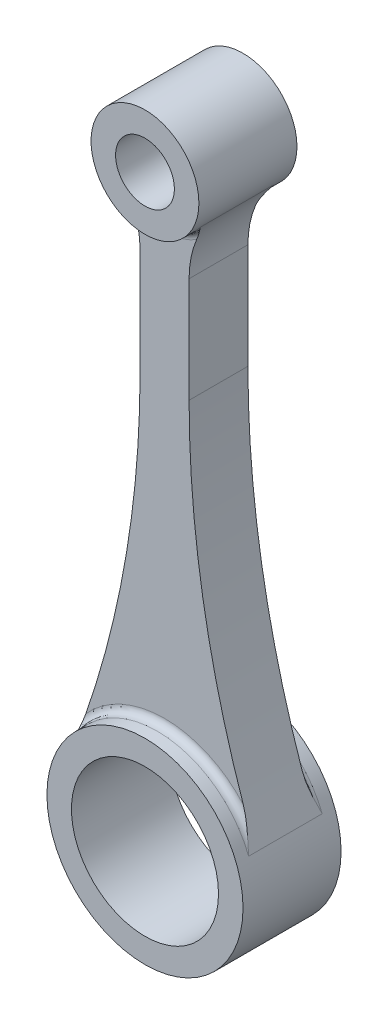
ISO-10303-21;
HEADER;
FILE_DESCRIPTION(('STEP AP214'),'2;1');
FILE_NAME('part.step','',(''),(''),'','','');
FILE_SCHEMA(('AUTOMOTIVE_DESIGN { 1 0 10303 214 1 1 1 1 }'));
ENDSEC;
DATA;
#1=APPLICATION_CONTEXT('core data for automotive mechanical design processes');
#2=APPLICATION_PROTOCOL_DEFINITION('international standard','automotive_design',2000,#1);
#3=PRODUCT_CONTEXT('',#1,'mechanical');
#4=PRODUCT('Part','Part','',(#3));
#5=PRODUCT_RELATED_PRODUCT_CATEGORY('part','',(#4));
#6=PRODUCT_DEFINITION_FORMATION('','',#4);
#7=PRODUCT_DEFINITION_CONTEXT('part definition',#1,'design');
#8=PRODUCT_DEFINITION('design','',#6,#7);
#9=PRODUCT_DEFINITION_SHAPE('','',#8);
#10=(LENGTH_UNIT() NAMED_UNIT(*) SI_UNIT(.MILLI.,.METRE.));
#11=(NAMED_UNIT(*) PLANE_ANGLE_UNIT() SI_UNIT($,.RADIAN.));
#12=(NAMED_UNIT(*) SI_UNIT($,.STERADIAN.) SOLID_ANGLE_UNIT());
#13=UNCERTAINTY_MEASURE_WITH_UNIT(LENGTH_MEASURE(1.E-05),#10,'distance_accuracy_value','');
#14=(GEOMETRIC_REPRESENTATION_CONTEXT(3) GLOBAL_UNCERTAINTY_ASSIGNED_CONTEXT((#13)) GLOBAL_UNIT_ASSIGNED_CONTEXT((#10,
#11,#12)) REPRESENTATION_CONTEXT('',''));
#15=CARTESIAN_POINT('',(0.,0.,0.));
#16=DIRECTION('',(0.,0.,1.));
#17=DIRECTION('',(1.,0.,0.));
#18=AXIS2_PLACEMENT_3D('',#15,#16,#17);
#19=CARTESIAN_POINT('',(0.,0.,10.));
#20=DIRECTION('',(0.,0.,-1.));
#21=DIRECTION('',(-1.,0.,0.));
#22=AXIS2_PLACEMENT_3D('',#19,#20,#21);
#23=CYLINDRICAL_SURFACE('',#22,20.);
#24=CARTESIAN_POINT('',(0.,0.,-10.));
#25=DIRECTION('',(0.,0.,1.));
#26=DIRECTION('',(1.,0.,0.));
#27=AXIS2_PLACEMENT_3D('',#24,#25,#26);
#28=CIRCLE('',#27,20.);
#29=CARTESIAN_POINT('',(20.,0.,-10.));
#30=VERTEX_POINT('',#29);
#31=EDGE_CURVE('E199',#30,#30,#28,.T.);
#32=ORIENTED_EDGE('',*,*,#31,.T.);
#33=EDGE_LOOP('',(#32));
#34=FACE_BOUND('',#33,.T.);
#35=CARTESIAN_POINT('',(0.,0.,10.));
#36=DIRECTION('',(0.,0.,1.));
#37=DIRECTION('',(1.,0.,0.));
#38=AXIS2_PLACEMENT_3D('',#35,#36,#37);
#39=CIRCLE('',#38,20.);
#40=CARTESIAN_POINT('',(20.,0.,10.));
#41=VERTEX_POINT('',#40);
#42=EDGE_CURVE('E203',#41,#41,#39,.T.);
#43=ORIENTED_EDGE('',*,*,#42,.F.);
#44=EDGE_LOOP('',(#43));
#45=FACE_BOUND('',#44,.T.);
#46=CARTESIAN_POINT('',(0.,0.,-7.5));
#47=DIRECTION('',(0.,0.,-1.));
#48=DIRECTION('',(-1.,0.,0.));
#49=AXIS2_PLACEMENT_3D('',#46,#47,#48);
#50=CIRCLE('',#49,20.);
#51=CARTESIAN_POINT('',(-18.6481142651053,7.22826634509108,-7.5));
#52=VERTEX_POINT('',#51);
#53=CARTESIAN_POINT('',(18.6481142651053,7.22826634509112,-7.5));
#54=VERTEX_POINT('',#53);
#55=EDGE_CURVE('E214',#52,#54,#50,.T.);
#56=ORIENTED_EDGE('',*,*,#55,.T.);
#57=DIRECTION('',(0.,0.,-1.));
#58=VECTOR('',#57,1.);
#59=CARTESIAN_POINT('',(18.6481142651053,7.22826634509114,6.));
#60=LINE('',#59,#58);
#61=CARTESIAN_POINT('',(18.6481142651053,7.22826634509112,7.5));
#62=VERTEX_POINT('',#61);
#63=EDGE_CURVE('E190',#62,#54,#60,.T.);
#64=ORIENTED_EDGE('',*,*,#63,.F.);
#65=CARTESIAN_POINT('',(0.,0.,7.5));
#66=DIRECTION('',(0.,0.,-1.));
#67=DIRECTION('',(-1.,0.,0.));
#68=AXIS2_PLACEMENT_3D('',#65,#66,#67);
#69=CIRCLE('',#68,20.);
#70=CARTESIAN_POINT('',(-18.6481142651053,7.22826634509108,7.5));
#71=VERTEX_POINT('',#70);
#72=EDGE_CURVE('E207',#62,#71,#69,.F.);
#73=ORIENTED_EDGE('',*,*,#72,.T.);
#74=DIRECTION('',(0.,0.,-1.));
#75=VECTOR('',#74,1.);
#76=CARTESIAN_POINT('',(-18.6481142651053,7.22826634509108,6.));
#77=LINE('',#76,#75);
#78=EDGE_CURVE('E158',#71,#52,#77,.T.);
#79=ORIENTED_EDGE('',*,*,#78,.T.);
#80=EDGE_LOOP('',(#56,#64,#73,#79));
#81=FACE_BOUND('',#80,.T.);
#82=ADVANCED_FACE('F44',(#34,#45,#81),#23,.T.);
#83=CARTESIAN_POINT('',(0.,0.,10.));
#84=DIRECTION('',(0.,0.,1.));
#85=DIRECTION('',(1.,0.,0.));
#86=AXIS2_PLACEMENT_3D('',#83,#84,#85);
#87=PLANE('',#86);
#88=ORIENTED_EDGE('',*,*,#42,.T.);
#89=EDGE_LOOP('',(#88));
#90=FACE_BOUND('',#89,.T.);
#91=CARTESIAN_POINT('',(0.,0.,10.));
#92=DIRECTION('',(0.,0.,1.));
#93=DIRECTION('',(1.,0.,0.));
#94=AXIS2_PLACEMENT_3D('',#91,#92,#93);
#95=CIRCLE('',#94,15.);
#96=CARTESIAN_POINT('',(15.,0.,10.));
#97=VERTEX_POINT('',#96);
#98=EDGE_CURVE('E195',#97,#97,#95,.T.);
#99=ORIENTED_EDGE('',*,*,#98,.F.);
#100=EDGE_LOOP('',(#99));
#101=FACE_BOUND('',#100,.T.);
#102=ADVANCED_FACE('F374',(#90,#101),#87,.T.);
#103=CARTESIAN_POINT('',(0.,0.,-10.));
#104=DIRECTION('',(0.,0.,1.));
#105=DIRECTION('',(1.,0.,0.));
#106=AXIS2_PLACEMENT_3D('',#103,#104,#105);
#107=PLANE('',#106);
#108=ORIENTED_EDGE('',*,*,#31,.F.);
#109=EDGE_LOOP('',(#108));
#110=FACE_BOUND('',#109,.T.);
#111=CARTESIAN_POINT('',(0.,0.,-10.));
#112=DIRECTION('',(0.,0.,1.));
#113=DIRECTION('',(1.,0.,0.));
#114=AXIS2_PLACEMENT_3D('',#111,#112,#113);
#115=CIRCLE('',#114,15.);
#116=CARTESIAN_POINT('',(15.,0.,-10.));
#117=VERTEX_POINT('',#116);
#118=EDGE_CURVE('E157',#117,#117,#115,.T.);
#119=ORIENTED_EDGE('',*,*,#118,.T.);
#120=EDGE_LOOP('',(#119));
#121=FACE_BOUND('',#120,.T.);
#122=ADVANCED_FACE('F379',(#110,#121),#107,.F.);
#123=CARTESIAN_POINT('',(0.,0.,10.));
#124=DIRECTION('',(0.,0.,-1.));
#125=DIRECTION('',(-1.,0.,0.));
#126=AXIS2_PLACEMENT_3D('',#123,#124,#125);
#127=CYLINDRICAL_SURFACE('',#126,15.);
#128=ORIENTED_EDGE('',*,*,#98,.T.);
#129=EDGE_LOOP('',(#128));
#130=FACE_BOUND('',#129,.T.);
#131=ORIENTED_EDGE('',*,*,#118,.F.);
#132=EDGE_LOOP('',(#131));
#133=FACE_BOUND('',#132,.T.);
#134=ADVANCED_FACE('F385',(#130,#133),#127,.F.);
#135=CARTESIAN_POINT('',(-5.,80.2020410288673,6.));
#136=DIRECTION('',(1.,0.,0.));
#137=DIRECTION('',(0.,1.,0.));
#138=AXIS2_PLACEMENT_3D('',#135,#136,#137);
#139=PLANE('',#138);
#140=DIRECTION('',(0.,-1.,0.));
#141=VECTOR('',#140,1.);
#142=CARTESIAN_POINT('',(-5.,80.2020410288673,6.));
#143=LINE('',#142,#141);
#144=CARTESIAN_POINT('',(-5.,101.669697220177,6.));
#145=VERTEX_POINT('',#144);
#146=CARTESIAN_POINT('',(-5.,80.2020410288673,6.));
#147=VERTEX_POINT('',#146);
#148=EDGE_CURVE('E134',#145,#147,#143,.T.);
#149=ORIENTED_EDGE('',*,*,#148,.F.);
#150=DIRECTION('',(0.,0.,1.));
#151=VECTOR('',#150,1.);
#152=CARTESIAN_POINT('',(-5.,101.669697220177,-7.5));
#153=LINE('',#152,#151);
#154=CARTESIAN_POINT('',(-5.,101.669697220177,-6.));
#155=VERTEX_POINT('',#154);
#156=EDGE_CURVE('E323',#145,#155,#153,.F.);
#157=ORIENTED_EDGE('',*,*,#156,.T.);
#158=DIRECTION('',(0.,-1.,0.));
#159=VECTOR('',#158,1.);
#160=CARTESIAN_POINT('',(-5.,80.2020410288673,-6.));
#161=LINE('',#160,#159);
#162=CARTESIAN_POINT('',(-5.,80.2020410288673,-6.));
#163=VERTEX_POINT('',#162);
#164=EDGE_CURVE('E152',#155,#163,#161,.T.);
#165=ORIENTED_EDGE('',*,*,#164,.T.);
#166=DIRECTION('',(0.,0.,-1.));
#167=VECTOR('',#166,1.);
#168=CARTESIAN_POINT('',(-5.,80.2020410288673,6.));
#169=LINE('',#168,#167);
#170=EDGE_CURVE('E149',#147,#163,#169,.T.);
#171=ORIENTED_EDGE('',*,*,#170,.F.);
#172=EDGE_LOOP('',(#149,#157,#165,#171));
#173=FACE_BOUND('',#172,.T.);
#174=ADVANCED_FACE('F150',(#173),#139,.F.);
#175=CARTESIAN_POINT('',(-206.912246173202,80.2020410288672,6.));
#176=DIRECTION('',(0.,0.,-1.));
#177=DIRECTION('',(-1.,0.,0.));
#178=AXIS2_PLACEMENT_3D('',#175,#176,#177);
#179=CYLINDRICAL_SURFACE('',#178,201.912246173202);
#180=CARTESIAN_POINT('',(-206.912246173202,80.2020410288672,-6.));
#181=DIRECTION('',(0.,0.,-1.));
#182=DIRECTION('',(1.,0.,0.));
#183=AXIS2_PLACEMENT_3D('',#180,#181,#182);
#184=CIRCLE('',#183,201.912246173202);
#185=CARTESIAN_POINT('',(-16.0593915870727,14.2949621144325,-6.));
#186=VERTEX_POINT('',#185);
#187=EDGE_CURVE('E177',#163,#186,#184,.T.);
#188=ORIENTED_EDGE('',*,*,#187,.T.);
#189=CARTESIAN_POINT('',(-16.0593915870727,14.2949621144325,-6.));
#190=CARTESIAN_POINT('',(-16.1006536952665,14.1754753958456,-6.00001602232113));
#191=CARTESIAN_POINT('',(-16.1420221672798,14.056045230023,-6.00236364174545));
#192=CARTESIAN_POINT('',(-16.2249250693908,13.8174294281518,-6.01122841546126));
#193=CARTESIAN_POINT('',(-16.2664594535394,13.6982437365954,-6.01774448543617));
#194=CARTESIAN_POINT('',(-16.3496188353413,13.4603293139339,-6.03444296750561));
#195=CARTESIAN_POINT('',(-16.3912436637869,13.3416002055109,-6.04462095780529));
#196=CARTESIAN_POINT('',(-16.4746143558801,13.1045050433052,-6.06824871526178));
#197=CARTESIAN_POINT('',(-16.5163602282244,12.9861390169326,-6.08169872356167));
#198=CARTESIAN_POINT('',(-16.641358281648,12.6327683299791,-6.12627700219547));
#199=CARTESIAN_POINT('',(-16.7247668152743,12.3983585047827,-6.16172009800662));
#200=CARTESIAN_POINT('',(-16.8919587539825,11.9312046260739,-6.24186223068281));
#201=CARTESIAN_POINT('',(-16.9757422854817,11.6984612159033,-6.28656466186992));
#202=CARTESIAN_POINT('',(-17.1890070534448,11.1094074843416,-6.40949821500748));
#203=CARTESIAN_POINT('',(-17.3187304550137,10.7542484759828,-6.49279850831369));
#204=CARTESIAN_POINT('',(-17.5791415039693,10.0474088872051,-6.67147800946801));
#205=CARTESIAN_POINT('',(-17.7098291679298,9.69572836681836,-6.76685742538829));
#206=CARTESIAN_POINT('',(-18.1041013686514,8.64365924994784,-7.06469767402785));
#207=CARTESIAN_POINT('',(-18.3695278193137,7.94725690796343,-7.27862120676119));
#208=CARTESIAN_POINT('',(-18.6418666749912,7.24438596708844,-7.49503656019267));
#209=CARTESIAN_POINT('',(-18.6449902140359,7.23632605190542,-7.49751829132768));
#210=CARTESIAN_POINT('',(-18.6481142651053,7.22826634509116,-7.5));
#211=B_SPLINE_CURVE_WITH_KNOTS('',3,(#189,#190,#191,#192,#193,#194,#195,#196,#197,#198,#199,
#200,#201,#202,#203,#204,#205,#206,#207,#208,#209,#210),.UNSPECIFIED.,.F.,.F.,(4,2,2,2,2,2,2,2,
2,2,4),(0.,0.379183324238902,0.75826805364844,1.13689656342641,1.51555298604591,
2.26926103822156,3.0232458780853,4.18443837654443,5.34565088015869,7.67138597053331,
7.69836558191353),.UNSPECIFIED.);
#212=EDGE_CURVE('E243',#186,#52,#211,.T.);
#213=ORIENTED_EDGE('',*,*,#212,.T.);
#214=ORIENTED_EDGE('',*,*,#78,.F.);
#215=CARTESIAN_POINT('',(-16.0593915870727,14.2949621144325,6.));
#216=CARTESIAN_POINT('',(-16.1006536952665,14.1754753958456,6.00001602232113));
#217=CARTESIAN_POINT('',(-16.1420221672798,14.056045230023,6.00236364174545));
#218=CARTESIAN_POINT('',(-16.2249250693908,13.8174294281518,6.01122841546126));
#219=CARTESIAN_POINT('',(-16.2664594535394,13.6982437365954,6.01774448543617));
#220=CARTESIAN_POINT('',(-16.3496188353413,13.4603293139339,6.0344429675056));
#221=CARTESIAN_POINT('',(-16.3912436637869,13.3416002055109,6.04462095780529));
#222=CARTESIAN_POINT('',(-16.4746143558801,13.1045050433052,6.06824871526178));
#223=CARTESIAN_POINT('',(-16.5163602282244,12.9861390169326,6.08169872356167));
#224=CARTESIAN_POINT('',(-16.641358281648,12.6327683299791,6.12627700219547));
#225=CARTESIAN_POINT('',(-16.7247668152743,12.3983585047827,6.16172009800662));
#226=CARTESIAN_POINT('',(-16.8919587539825,11.9312046260739,6.24186223068282));
#227=CARTESIAN_POINT('',(-16.9757422854817,11.6984612159033,6.28656466186992));
#228=CARTESIAN_POINT('',(-17.1890070534448,11.1094074843416,6.40949821500748));
#229=CARTESIAN_POINT('',(-17.3187304550137,10.7542484759828,6.49279850831369));
#230=CARTESIAN_POINT('',(-17.5791415039693,10.0474088872051,6.67147800946801));
#231=CARTESIAN_POINT('',(-17.7098291679298,9.69572836681836,6.76685742538829));
#232=CARTESIAN_POINT('',(-18.1041013686514,8.64365924994784,7.06469767402785));
#233=CARTESIAN_POINT('',(-18.3695278193137,7.94725690796343,7.27862120676119));
#234=CARTESIAN_POINT('',(-18.6418666749912,7.24438596708844,7.49503656019266));
#235=CARTESIAN_POINT('',(-18.6449902140359,7.23632605190542,7.49751829132768));
#236=CARTESIAN_POINT('',(-18.6481142651053,7.22826634509116,7.5));
#237=B_SPLINE_CURVE_WITH_KNOTS('',3,(#215,#216,#217,#218,#219,#220,#221,#222,#223,#224,#225,
#226,#227,#228,#229,#230,#231,#232,#233,#234,#235,#236),.UNSPECIFIED.,.F.,.F.,(4,2,2,2,2,2,2,2,
2,2,4),(0.,0.379183324238904,0.75826805364844,1.13689656342641,1.51555298604591,
2.26926103822156,3.0232458780853,4.18443837654443,5.34565088015869,7.67138597053331,
7.69836558191353),.UNSPECIFIED.);
#238=CARTESIAN_POINT('',(-16.0593915870727,14.2949621144325,6.));
#239=VERTEX_POINT('',#238);
#240=EDGE_CURVE('E162',#71,#239,#237,.F.);
#241=ORIENTED_EDGE('',*,*,#240,.T.);
#242=CARTESIAN_POINT('',(-206.912246173202,80.2020410288672,6.));
#243=DIRECTION('',(0.,0.,-1.));
#244=DIRECTION('',(1.,0.,0.));
#245=AXIS2_PLACEMENT_3D('',#242,#243,#244);
#246=CIRCLE('',#245,201.912246173202);
#247=EDGE_CURVE('E139',#147,#239,#246,.T.);
#248=ORIENTED_EDGE('',*,*,#247,.F.);
#249=ORIENTED_EDGE('',*,*,#170,.T.);
#250=EDGE_LOOP('',(#188,#213,#214,#241,#248,#249));
#251=FACE_BOUND('',#250,.T.);
#252=ADVANCED_FACE('F160',(#251),#179,.F.);
#253=CARTESIAN_POINT('',(206.912246173204,80.2020410288673,6.));
#254=DIRECTION('',(0.,0.,-1.));
#255=DIRECTION('',(-1.,0.,0.));
#256=AXIS2_PLACEMENT_3D('',#253,#254,#255);
#257=CYLINDRICAL_SURFACE('',#256,201.912246173204);
#258=ORIENTED_EDGE('',*,*,#63,.T.);
#259=CARTESIAN_POINT('',(16.0593915870727,14.2949621144324,-6.));
#260=CARTESIAN_POINT('',(16.1006536952665,14.1754753958459,-6.00001602232113));
#261=CARTESIAN_POINT('',(16.1420221672796,14.0560452300237,-6.00236364174544));
#262=CARTESIAN_POINT('',(16.2249250693904,13.8174294281531,-6.0112284154612));
#263=CARTESIAN_POINT('',(16.2664594535388,13.698243736597,-6.01774448543607));
#264=CARTESIAN_POINT('',(16.3496188353406,13.4603293139361,-6.03444296750543));
#265=CARTESIAN_POINT('',(16.3912436637861,13.3416002055134,-6.04462095780507));
#266=CARTESIAN_POINT('',(16.4746143558791,13.1045050433082,-6.06824871526146));
#267=CARTESIAN_POINT('',(16.5163602282233,12.9861390169358,-6.08169872356129));
#268=CARTESIAN_POINT('',(16.641358281647,12.6327683299819,-6.12627700219504));
#269=CARTESIAN_POINT('',(16.7247668152735,12.3983585047849,-6.16172009800622));
#270=CARTESIAN_POINT('',(16.8919587539821,11.9312046260749,-6.24186223068265));
#271=CARTESIAN_POINT('',(16.9757422854815,11.6984612159039,-6.28656466186996));
#272=CARTESIAN_POINT('',(17.1890070534449,11.1094074843414,-6.40949821500727));
#273=CARTESIAN_POINT('',(17.3187304550138,10.7542484759824,-6.49279850831264));
#274=CARTESIAN_POINT('',(17.5791415039694,10.0474088872049,-6.67147800946918));
#275=CARTESIAN_POINT('',(17.7098291679297,9.69572836681876,-6.76685742539254));
#276=CARTESIAN_POINT('',(18.1041013686524,8.64365924994506,-7.06469767401977));
#277=CARTESIAN_POINT('',(18.369527819318,7.94725690795104,-7.27862120671627));
#278=CARTESIAN_POINT('',(18.6418666749913,7.24438596708829,-7.49503656019157));
#279=CARTESIAN_POINT('',(18.6449902140359,7.23632605190533,-7.49751829132713));
#280=CARTESIAN_POINT('',(18.6481142651053,7.22826634509112,-7.5));
#281=B_SPLINE_CURVE_WITH_KNOTS('',3,(#259,#260,#261,#262,#263,#264,#265,#266,#267,#268,#269,
#270,#271,#272,#273,#274,#275,#276,#277,#278,#279,#280),.UNSPECIFIED.,.F.,.F.,(4,2,2,2,2,2,2,2,
2,2,4),(0.,0.379183324237857,0.758268053646341,1.13689656342349,1.51555298604217,
2.26926103821981,3.02324587808531,4.18443837654466,5.34565088015969,7.67138597053305,
7.69836558191354),.UNSPECIFIED.);
#282=CARTESIAN_POINT('',(16.0593915870727,14.2949621144324,-6.));
#283=VERTEX_POINT('',#282);
#284=EDGE_CURVE('E234',#54,#283,#281,.F.);
#285=ORIENTED_EDGE('',*,*,#284,.T.);
#286=CARTESIAN_POINT('',(206.912246173204,80.2020410288673,-6.));
#287=DIRECTION('',(0.,0.,-1.));
#288=DIRECTION('',(1.,0.,0.));
#289=AXIS2_PLACEMENT_3D('',#286,#287,#288);
#290=CIRCLE('',#289,201.912246173204);
#291=CARTESIAN_POINT('',(5.00000000000003,80.2020410288673,-6.));
#292=VERTEX_POINT('',#291);
#293=EDGE_CURVE('E181',#283,#292,#290,.T.);
#294=ORIENTED_EDGE('',*,*,#293,.T.);
#295=DIRECTION('',(0.,0.,-1.));
#296=VECTOR('',#295,1.);
#297=CARTESIAN_POINT('',(5.00000000000003,80.2020410288673,6.));
#298=LINE('',#297,#296);
#299=CARTESIAN_POINT('',(5.00000000000003,80.2020410288673,6.));
#300=VERTEX_POINT('',#299);
#301=EDGE_CURVE('E174',#300,#292,#298,.T.);
#302=ORIENTED_EDGE('',*,*,#301,.F.);
#303=CARTESIAN_POINT('',(206.912246173204,80.2020410288673,6.));
#304=DIRECTION('',(0.,0.,-1.));
#305=DIRECTION('',(1.,0.,0.));
#306=AXIS2_PLACEMENT_3D('',#303,#304,#305);
#307=CIRCLE('',#306,201.912246173204);
#308=CARTESIAN_POINT('',(16.0593915870727,14.2949621144324,6.));
#309=VERTEX_POINT('',#308);
#310=EDGE_CURVE('E164',#309,#300,#307,.T.);
#311=ORIENTED_EDGE('',*,*,#310,.F.);
#312=CARTESIAN_POINT('',(16.0593915870727,14.2949621144324,6.));
#313=CARTESIAN_POINT('',(16.1006536952665,14.1754753958459,6.00001602232113));
#314=CARTESIAN_POINT('',(16.1420221672796,14.0560452300237,6.00236364174543));
#315=CARTESIAN_POINT('',(16.2249250693904,13.8174294281531,6.01122841546119));
#316=CARTESIAN_POINT('',(16.2664594535388,13.698243736597,6.01774448543607));
#317=CARTESIAN_POINT('',(16.3496188353406,13.4603293139361,6.03444296750542));
#318=CARTESIAN_POINT('',(16.3912436637861,13.3416002055134,6.04462095780506));
#319=CARTESIAN_POINT('',(16.4746143558791,13.1045050433082,6.06824871526146));
#320=CARTESIAN_POINT('',(16.5163602282233,12.9861390169358,6.08169872356129));
#321=CARTESIAN_POINT('',(16.641358281647,12.6327683299819,6.12627700219504));
#322=CARTESIAN_POINT('',(16.7247668152735,12.3983585047849,6.16172009800622));
#323=CARTESIAN_POINT('',(16.8919587539821,11.9312046260749,6.24186223068265));
#324=CARTESIAN_POINT('',(16.9757422854815,11.6984612159039,6.28656466186996));
#325=CARTESIAN_POINT('',(17.1890070534449,11.1094074843414,6.40949821500726));
#326=CARTESIAN_POINT('',(17.3187304550138,10.7542484759824,6.49279850831264));
#327=CARTESIAN_POINT('',(17.5791415039694,10.0474088872049,6.67147800946918));
#328=CARTESIAN_POINT('',(17.7098291679297,9.69572836681876,6.76685742539254));
#329=CARTESIAN_POINT('',(18.1041013686524,8.64365924994506,7.06469767401977));
#330=CARTESIAN_POINT('',(18.369527819318,7.94725690795104,7.27862120671627));
#331=CARTESIAN_POINT('',(18.6418666749913,7.24438596708829,7.49503656019157));
#332=CARTESIAN_POINT('',(18.6449902140359,7.23632605190533,7.49751829132713));
#333=CARTESIAN_POINT('',(18.6481142651053,7.22826634509112,7.5));
#334=B_SPLINE_CURVE_WITH_KNOTS('',3,(#312,#313,#314,#315,#316,#317,#318,#319,#320,#321,#322,
#323,#324,#325,#326,#327,#328,#329,#330,#331,#332,#333),.UNSPECIFIED.,.F.,.F.,(4,2,2,2,2,2,2,2,
2,2,4),(0.,0.379183324237857,0.758268053646341,1.13689656342349,1.51555298604217,
2.26926103821981,3.02324587808531,4.18443837654466,5.34565088015969,7.67138597053305,
7.69836558191354),.UNSPECIFIED.);
#335=EDGE_CURVE('E264',#309,#62,#334,.T.);
#336=ORIENTED_EDGE('',*,*,#335,.T.);
#337=EDGE_LOOP('',(#258,#285,#294,#302,#311,#336));
#338=FACE_BOUND('',#337,.T.);
#339=ADVANCED_FACE('F254',(#338),#257,.F.);
#340=CARTESIAN_POINT('',(5.,110.202041028867,6.));
#341=DIRECTION('',(-1.,0.,0.));
#342=DIRECTION('',(0.,-1.,0.));
#343=AXIS2_PLACEMENT_3D('',#340,#341,#342);
#344=PLANE('',#343);
#345=DIRECTION('',(0.,1.,0.));
#346=VECTOR('',#345,1.);
#347=CARTESIAN_POINT('',(5.,110.202041028867,-6.));
#348=LINE('',#347,#346);
#349=CARTESIAN_POINT('',(5.,101.669697220177,-6.));
#350=VERTEX_POINT('',#349);
#351=EDGE_CURVE('E146',#292,#350,#348,.T.);
#352=ORIENTED_EDGE('',*,*,#351,.T.);
#353=DIRECTION('',(0.,0.,1.));
#354=VECTOR('',#353,1.);
#355=CARTESIAN_POINT('',(5.,101.669697220177,7.5));
#356=LINE('',#355,#354);
#357=CARTESIAN_POINT('',(5.,101.669697220177,6.));
#358=VERTEX_POINT('',#357);
#359=EDGE_CURVE('E346',#350,#358,#356,.T.);
#360=ORIENTED_EDGE('',*,*,#359,.T.);
#361=DIRECTION('',(0.,1.,0.));
#362=VECTOR('',#361,1.);
#363=CARTESIAN_POINT('',(5.,110.202041028867,6.));
#364=LINE('',#363,#362);
#365=EDGE_CURVE('E167',#300,#358,#364,.T.);
#366=ORIENTED_EDGE('',*,*,#365,.F.);
#367=ORIENTED_EDGE('',*,*,#301,.T.);
#368=EDGE_LOOP('',(#352,#360,#366,#367));
#369=FACE_BOUND('',#368,.T.);
#370=ADVANCED_FACE('F258',(#369),#344,.F.);
#371=CARTESIAN_POINT('',(1.52655665885959E-13,120.000000000002,6.));
#372=DIRECTION('',(0.,0.,-1.));
#373=DIRECTION('',(-1.,0.,0.));
#374=AXIS2_PLACEMENT_3D('',#371,#372,#373);
#375=PLANE('',#374);
#376=ORIENTED_EDGE('',*,*,#247,.T.);
#377=CARTESIAN_POINT('',(0.,0.,6.));
#378=DIRECTION('',(0.,0.,-1.));
#379=DIRECTION('',(-1.,0.,0.));
#380=AXIS2_PLACEMENT_3D('',#377,#378,#379);
#381=CIRCLE('',#380,21.5);
#382=EDGE_CURVE('E225',#239,#309,#381,.T.);
#383=ORIENTED_EDGE('',*,*,#382,.T.);
#384=ORIENTED_EDGE('',*,*,#310,.T.);
#385=ORIENTED_EDGE('',*,*,#365,.T.);
#386=CARTESIAN_POINT('',(25.,101.669697220177,6.));
#387=DIRECTION('',(0.,0.,-1.));
#388=DIRECTION('',(-1.,0.,0.));
#389=AXIS2_PLACEMENT_3D('',#386,#387,#388);
#390=CIRCLE('',#389,20.);
#391=CARTESIAN_POINT('',(6.52976453851341,109.341098786856,6.));
#392=VERTEX_POINT('',#391);
#393=EDGE_CURVE('E307',#358,#392,#390,.T.);
#394=ORIENTED_EDGE('',*,*,#393,.T.);
#395=CARTESIAN_POINT('',(0.,120.,6.));
#396=DIRECTION('',(0.,0.,-1.));
#397=DIRECTION('',(-1.,0.,0.));
#398=AXIS2_PLACEMENT_3D('',#395,#396,#397);
#399=CIRCLE('',#398,12.5);
#400=CARTESIAN_POINT('',(-6.52976453851341,109.341098786856,6.));
#401=VERTEX_POINT('',#400);
#402=EDGE_CURVE('E60',#392,#401,#399,.T.);
#403=ORIENTED_EDGE('',*,*,#402,.T.);
#404=CARTESIAN_POINT('',(-25.,101.669697220177,6.));
#405=DIRECTION('',(0.,0.,-1.));
#406=DIRECTION('',(-1.,0.,0.));
#407=AXIS2_PLACEMENT_3D('',#404,#405,#406);
#408=CIRCLE('',#407,20.);
#409=EDGE_CURVE('E11',#401,#145,#408,.T.);
#410=ORIENTED_EDGE('',*,*,#409,.T.);
#411=ORIENTED_EDGE('',*,*,#148,.T.);
#412=EDGE_LOOP('',(#376,#383,#384,#385,#394,#403,#410,#411));
#413=FACE_BOUND('',#412,.T.);
#414=ADVANCED_FACE('F136',(#413),#375,.F.);
#415=CARTESIAN_POINT('',(1.52655665885959E-13,120.000000000002,-6.));
#416=DIRECTION('',(0.,0.,-1.));
#417=DIRECTION('',(-1.,0.,0.));
#418=AXIS2_PLACEMENT_3D('',#415,#416,#417);
#419=PLANE('',#418);
#420=ORIENTED_EDGE('',*,*,#293,.F.);
#421=CARTESIAN_POINT('',(0.,0.,-6.));
#422=DIRECTION('',(0.,0.,-1.));
#423=DIRECTION('',(-1.,0.,0.));
#424=AXIS2_PLACEMENT_3D('',#421,#422,#423);
#425=CIRCLE('',#424,21.5);
#426=EDGE_CURVE('E220',#283,#186,#425,.F.);
#427=ORIENTED_EDGE('',*,*,#426,.T.);
#428=ORIENTED_EDGE('',*,*,#187,.F.);
#429=ORIENTED_EDGE('',*,*,#164,.F.);
#430=CARTESIAN_POINT('',(-25.,101.669697220177,-6.));
#431=DIRECTION('',(0.,0.,-1.));
#432=DIRECTION('',(-1.,0.,0.));
#433=AXIS2_PLACEMENT_3D('',#430,#431,#432);
#434=CIRCLE('',#433,20.);
#435=CARTESIAN_POINT('',(-6.52976453851341,109.341098786856,-6.));
#436=VERTEX_POINT('',#435);
#437=EDGE_CURVE('E306',#155,#436,#434,.F.);
#438=ORIENTED_EDGE('',*,*,#437,.T.);
#439=CARTESIAN_POINT('',(0.,120.,-6.));
#440=DIRECTION('',(0.,0.,-1.));
#441=DIRECTION('',(-1.,0.,0.));
#442=AXIS2_PLACEMENT_3D('',#439,#440,#441);
#443=CIRCLE('',#442,12.5);
#444=CARTESIAN_POINT('',(6.52976453851341,109.341098786856,-6.));
#445=VERTEX_POINT('',#444);
#446=EDGE_CURVE('E68',#436,#445,#443,.F.);
#447=ORIENTED_EDGE('',*,*,#446,.T.);
#448=CARTESIAN_POINT('',(25.,101.669697220177,-6.));
#449=DIRECTION('',(0.,0.,-1.));
#450=DIRECTION('',(-1.,0.,0.));
#451=AXIS2_PLACEMENT_3D('',#448,#449,#450);
#452=CIRCLE('',#451,20.);
#453=EDGE_CURVE('E322',#445,#350,#452,.F.);
#454=ORIENTED_EDGE('',*,*,#453,.T.);
#455=ORIENTED_EDGE('',*,*,#351,.F.);
#456=EDGE_LOOP('',(#420,#427,#428,#429,#438,#447,#454,#455));
#457=FACE_BOUND('',#456,.T.);
#458=ADVANCED_FACE('F371',(#457),#419,.T.);
#459=CARTESIAN_POINT('',(0.,120.,10.));
#460=DIRECTION('',(0.,0.,-1.));
#461=DIRECTION('',(-1.,0.,0.));
#462=AXIS2_PLACEMENT_3D('',#459,#460,#461);
#463=CYLINDRICAL_SURFACE('',#462,11.);
#464=CARTESIAN_POINT('',(0.,120.,10.));
#465=DIRECTION('',(0.,0.,1.));
#466=DIRECTION('',(1.,0.,0.));
#467=AXIS2_PLACEMENT_3D('',#464,#465,#466);
#468=CIRCLE('',#467,11.);
#469=CARTESIAN_POINT('',(11.,120.,10.));
#470=VERTEX_POINT('',#469);
#471=EDGE_CURVE('E571',#470,#470,#468,.T.);
#472=ORIENTED_EDGE('',*,*,#471,.F.);
#473=EDGE_LOOP('',(#472));
#474=FACE_BOUND('',#473,.T.);
#475=CARTESIAN_POINT('',(0.,120.,-10.));
#476=DIRECTION('',(0.,0.,1.));
#477=DIRECTION('',(1.,0.,0.));
#478=AXIS2_PLACEMENT_3D('',#475,#476,#477);
#479=CIRCLE('',#478,11.);
#480=CARTESIAN_POINT('',(11.,120.,-10.));
#481=VERTEX_POINT('',#480);
#482=EDGE_CURVE('E576',#481,#481,#479,.T.);
#483=ORIENTED_EDGE('',*,*,#482,.T.);
#484=EDGE_LOOP('',(#483));
#485=FACE_BOUND('',#484,.T.);
#486=DIRECTION('',(0.,0.,-1.));
#487=VECTOR('',#486,1.);
#488=CARTESIAN_POINT('',(8.87096774193548,113.495699013611,10.));
#489=LINE('',#488,#487);
#490=CARTESIAN_POINT('',(8.87096774193548,113.495699013611,7.5));
#491=VERTEX_POINT('',#490);
#492=CARTESIAN_POINT('',(8.87096774193548,113.495699013611,-7.5));
#493=VERTEX_POINT('',#492);
#494=EDGE_CURVE('E337',#491,#493,#489,.T.);
#495=ORIENTED_EDGE('',*,*,#494,.T.);
#496=CARTESIAN_POINT('',(0.,120.,-7.5));
#497=DIRECTION('',(0.,0.,-1.));
#498=DIRECTION('',(-1.,0.,0.));
#499=AXIS2_PLACEMENT_3D('',#496,#497,#498);
#500=CIRCLE('',#499,11.);
#501=CARTESIAN_POINT('',(-8.87096774193548,113.495699013611,-7.5));
#502=VERTEX_POINT('',#501);
#503=EDGE_CURVE('E228',#493,#502,#500,.T.);
#504=ORIENTED_EDGE('',*,*,#503,.T.);
#505=DIRECTION('',(0.,0.,-1.));
#506=VECTOR('',#505,1.);
#507=CARTESIAN_POINT('',(-8.87096774193548,113.495699013611,10.));
#508=LINE('',#507,#506);
#509=CARTESIAN_POINT('',(-8.87096774193548,113.495699013611,7.5));
#510=VERTEX_POINT('',#509);
#511=EDGE_CURVE('E350',#502,#510,#508,.F.);
#512=ORIENTED_EDGE('',*,*,#511,.T.);
#513=CARTESIAN_POINT('',(0.,120.,7.5));
#514=DIRECTION('',(0.,0.,-1.));
#515=DIRECTION('',(-1.,0.,0.));
#516=AXIS2_PLACEMENT_3D('',#513,#514,#515);
#517=CIRCLE('',#516,11.);
#518=EDGE_CURVE('E231',#510,#491,#517,.F.);
#519=ORIENTED_EDGE('',*,*,#518,.T.);
#520=EDGE_LOOP('',(#495,#504,#512,#519));
#521=FACE_BOUND('',#520,.T.);
#522=ADVANCED_FACE('F446',(#474,#485,#521),#463,.T.);
#523=CARTESIAN_POINT('',(0.,120.,10.));
#524=DIRECTION('',(0.,0.,1.));
#525=DIRECTION('',(1.,0.,0.));
#526=AXIS2_PLACEMENT_3D('',#523,#524,#525);
#527=PLANE('',#526);
#528=ORIENTED_EDGE('',*,*,#471,.T.);
#529=EDGE_LOOP('',(#528));
#530=FACE_BOUND('',#529,.T.);
#531=CARTESIAN_POINT('',(0.,120.,10.));
#532=DIRECTION('',(0.,0.,1.));
#533=DIRECTION('',(1.,0.,0.));
#534=AXIS2_PLACEMENT_3D('',#531,#532,#533);
#535=CIRCLE('',#534,6.);
#536=CARTESIAN_POINT('',(6.,120.,10.));
#537=VERTEX_POINT('',#536);
#538=EDGE_CURVE('E574',#537,#537,#535,.T.);
#539=ORIENTED_EDGE('',*,*,#538,.F.);
#540=EDGE_LOOP('',(#539));
#541=FACE_BOUND('',#540,.T.);
#542=ADVANCED_FACE('F455',(#530,#541),#527,.T.);
#543=CARTESIAN_POINT('',(0.,120.,-10.));
#544=DIRECTION('',(0.,0.,1.));
#545=DIRECTION('',(1.,0.,0.));
#546=AXIS2_PLACEMENT_3D('',#543,#544,#545);
#547=PLANE('',#546);
#548=ORIENTED_EDGE('',*,*,#482,.F.);
#549=EDGE_LOOP('',(#548));
#550=FACE_BOUND('',#549,.T.);
#551=CARTESIAN_POINT('',(0.,120.,-10.));
#552=DIRECTION('',(0.,0.,1.));
#553=DIRECTION('',(1.,0.,0.));
#554=AXIS2_PLACEMENT_3D('',#551,#552,#553);
#555=CIRCLE('',#554,6.);
#556=CARTESIAN_POINT('',(6.,120.,-10.));
#557=VERTEX_POINT('',#556);
#558=EDGE_CURVE('E178',#557,#557,#555,.T.);
#559=ORIENTED_EDGE('',*,*,#558,.T.);
#560=EDGE_LOOP('',(#559));
#561=FACE_BOUND('',#560,.T.);
#562=ADVANCED_FACE('F512',(#550,#561),#547,.F.);
#563=CARTESIAN_POINT('',(0.,120.,10.));
#564=DIRECTION('',(0.,0.,-1.));
#565=DIRECTION('',(-1.,0.,0.));
#566=AXIS2_PLACEMENT_3D('',#563,#564,#565);
#567=CYLINDRICAL_SURFACE('',#566,6.);
#568=ORIENTED_EDGE('',*,*,#538,.T.);
#569=EDGE_LOOP('',(#568));
#570=FACE_BOUND('',#569,.T.);
#571=ORIENTED_EDGE('',*,*,#558,.F.);
#572=EDGE_LOOP('',(#571));
#573=FACE_BOUND('',#572,.T.);
#574=ADVANCED_FACE('F411',(#570,#573),#567,.F.);
#575=CARTESIAN_POINT('',(0.,0.,-7.5));
#576=DIRECTION('',(0.,0.,-1.));
#577=DIRECTION('',(-1.,0.,0.));
#578=AXIS2_PLACEMENT_3D('',#575,#576,#577);
#579=TOROIDAL_SURFACE('',#578,21.5,1.5);
#580=ORIENTED_EDGE('',*,*,#212,.F.);
#581=ORIENTED_EDGE('',*,*,#426,.F.);
#582=ORIENTED_EDGE('',*,*,#284,.F.);
#583=ORIENTED_EDGE('',*,*,#55,.F.);
#584=EDGE_LOOP('',(#580,#581,#582,#583));
#585=FACE_BOUND('',#584,.T.);
#586=ADVANCED_FACE('F250',(#585),#579,.F.);
#587=CARTESIAN_POINT('',(0.,0.,7.5));
#588=DIRECTION('',(0.,0.,-1.));
#589=DIRECTION('',(-1.,0.,0.));
#590=AXIS2_PLACEMENT_3D('',#587,#588,#589);
#591=TOROIDAL_SURFACE('',#590,21.5,1.5);
#592=ORIENTED_EDGE('',*,*,#240,.F.);
#593=ORIENTED_EDGE('',*,*,#72,.F.);
#594=ORIENTED_EDGE('',*,*,#335,.F.);
#595=ORIENTED_EDGE('',*,*,#382,.F.);
#596=EDGE_LOOP('',(#592,#593,#594,#595));
#597=FACE_BOUND('',#596,.T.);
#598=ADVANCED_FACE('F277',(#597),#591,.F.);
#599=CARTESIAN_POINT('',(0.,120.,7.5));
#600=DIRECTION('',(0.,0.,-1.));
#601=DIRECTION('',(-1.,0.,0.));
#602=AXIS2_PLACEMENT_3D('',#599,#600,#601);
#603=TOROIDAL_SURFACE('',#602,12.5,1.5);
#604=ORIENTED_EDGE('',*,*,#402,.F.);
#605=CARTESIAN_POINT('',(6.52976453851341,109.341098786856,6.));
#606=CARTESIAN_POINT('',(6.56118335819645,109.416747920779,6.00000925177807));
#607=CARTESIAN_POINT('',(6.59305602448853,109.492171876019,6.00231164516611));
#608=CARTESIAN_POINT('',(6.65761775350314,109.642380754179,6.01103347793262));
#609=CARTESIAN_POINT('',(6.6903063175374,109.717166031682,6.01745045890384));
#610=CARTESIAN_POINT('',(6.78931397381707,109.939961264202,6.04212441147732));
#611=CARTESIAN_POINT('',(6.85676792440635,110.086874644218,6.06581023051465));
#612=CARTESIAN_POINT('',(6.99350158938875,110.375515680494,6.12436470006733));
#613=CARTESIAN_POINT('',(7.06275434412662,110.517281815677,6.1591120527891));
#614=CARTESIAN_POINT('',(7.20358444297658,110.797247014589,6.2376098431051));
#615=CARTESIAN_POINT('',(7.27516380163185,110.935442790441,6.28136826800813));
#616=CARTESIAN_POINT('',(7.46301782611863,111.288135152223,6.40371242923489));
#617=CARTESIAN_POINT('',(7.5809062569468,111.499893338872,6.48768150142449));
#618=CARTESIAN_POINT('',(7.82184465737965,111.915117050018,6.66761005920632));
#619=CARTESIAN_POINT('',(7.94489547396898,112.118581202842,6.76357151752186));
#620=CARTESIAN_POINT('',(8.19678616505608,112.519035660713,6.96327814534931));
#621=CARTESIAN_POINT('',(8.32564406752558,112.716001970417,7.06704833575545));
#622=CARTESIAN_POINT('',(8.58921706524269,113.103908169925,7.27819082606815));
#623=CARTESIAN_POINT('',(8.72393100109155,113.294849239824,7.38556241200456));
#624=CARTESIAN_POINT('',(8.8649348436307,113.487467664241,7.49530812204743));
#625=CARTESIAN_POINT('',(8.86795050956883,113.49158391814,7.49765406358585));
#626=CARTESIAN_POINT('',(8.87096774193548,113.495699013611,7.5));
#627=B_SPLINE_CURVE_WITH_KNOTS('',3,(#605,#606,#607,#608,#609,#610,#611,#612,#613,#614,#615,
#616,#617,#618,#619,#620,#621,#622,#623,#624,#625,#626),.UNSPECIFIED.,.F.,.F.,(4,2,2,2,2,2,2,2,
2,2,4),(0.,0.24565600891225,0.491165378466543,0.980682937117632,1.46500748572424,
1.94976319620688,2.71855630954779,3.48747605468036,4.25897409193311,5.03032007474104,
5.04716854660824),.UNSPECIFIED.);
#628=EDGE_CURVE('E297',#392,#491,#627,.T.);
#629=ORIENTED_EDGE('',*,*,#628,.T.);
#630=ORIENTED_EDGE('',*,*,#518,.F.);
#631=CARTESIAN_POINT('',(-6.52976453851341,109.341098786856,6.));
#632=CARTESIAN_POINT('',(-6.56118335819638,109.416747920778,6.00000925177807));
#633=CARTESIAN_POINT('',(-6.59305602448839,109.492171876018,6.0023116451661));
#634=CARTESIAN_POINT('',(-6.65761775350285,109.642380754179,6.01103347793257));
#635=CARTESIAN_POINT('',(-6.69030631753705,109.717166031681,6.01745045890376));
#636=CARTESIAN_POINT('',(-6.78931397381652,109.939961264201,6.04212441147715));
#637=CARTESIAN_POINT('',(-6.85676792440568,110.086874644216,6.0658102305144));
#638=CARTESIAN_POINT('',(-6.9935015893881,110.375515680493,6.12436470006701));
#639=CARTESIAN_POINT('',(-7.06275434412609,110.517281815676,6.15911205278882));
#640=CARTESIAN_POINT('',(-7.20358444297633,110.797247014589,6.23760984310493));
#641=CARTESIAN_POINT('',(-7.27516380163172,110.935442790441,6.28136826800802));
#642=CARTESIAN_POINT('',(-7.46301782611864,111.288135152223,6.40371242923494));
#643=CARTESIAN_POINT('',(-7.5809062569468,111.499893338873,6.48768150142467));
#644=CARTESIAN_POINT('',(-7.82184465737982,111.915117050018,6.66761005920627));
#645=CARTESIAN_POINT('',(-7.94489547396935,112.118581202843,6.76357151752146));
#646=CARTESIAN_POINT('',(-8.19678616505618,112.519035660713,6.96327814535007));
#647=CARTESIAN_POINT('',(-8.32564406752521,112.716001970416,7.06704833575771));
#648=CARTESIAN_POINT('',(-8.58921706524341,113.103908169926,7.27819082606617));
#649=CARTESIAN_POINT('',(-8.72393100109382,113.294849239827,7.38556241199681));
#650=CARTESIAN_POINT('',(-8.8649348436308,113.487467664242,7.4953081220471));
#651=CARTESIAN_POINT('',(-8.86795050956888,113.49158391814,7.49765406358568));
#652=CARTESIAN_POINT('',(-8.87096774193548,113.495699013611,7.5));
#653=B_SPLINE_CURVE_WITH_KNOTS('',3,(#631,#632,#633,#634,#635,#636,#637,#638,#639,#640,#641,
#642,#643,#644,#645,#646,#647,#648,#649,#650,#651,#652),.UNSPECIFIED.,.F.,.F.,(4,2,2,2,2,2,2,2,
2,2,4),(0.,0.245656008911706,0.491165378465475,0.980682937115748,1.46500748572336,
1.94976319620688,2.71855630954793,3.48747605468094,4.25897409193347,5.03032007474106,
5.04716854660824),.UNSPECIFIED.);
#654=EDGE_CURVE('E54',#510,#401,#653,.F.);
#655=ORIENTED_EDGE('',*,*,#654,.T.);
#656=EDGE_LOOP('',(#604,#629,#630,#655));
#657=FACE_BOUND('',#656,.T.);
#658=ADVANCED_FACE('F281',(#657),#603,.F.);
#659=CARTESIAN_POINT('',(0.,120.,-7.5));
#660=DIRECTION('',(0.,0.,-1.));
#661=DIRECTION('',(-1.,0.,0.));
#662=AXIS2_PLACEMENT_3D('',#659,#660,#661);
#663=TOROIDAL_SURFACE('',#662,12.5,1.5);
#664=ORIENTED_EDGE('',*,*,#503,.F.);
#665=CARTESIAN_POINT('',(6.52976453851341,109.341098786856,-6.));
#666=CARTESIAN_POINT('',(6.56118335819645,109.416747920779,-6.00000925177808));
#667=CARTESIAN_POINT('',(6.59305602448853,109.492171876019,-6.00231164516611));
#668=CARTESIAN_POINT('',(6.65761775350314,109.642380754179,-6.01103347793262));
#669=CARTESIAN_POINT('',(6.69030631753741,109.717166031682,-6.01745045890384));
#670=CARTESIAN_POINT('',(6.78931397381707,109.939961264202,-6.04212441147732));
#671=CARTESIAN_POINT('',(6.85676792440635,110.086874644218,-6.06581023051465));
#672=CARTESIAN_POINT('',(6.99350158938875,110.375515680494,-6.12436470006733));
#673=CARTESIAN_POINT('',(7.06275434412662,110.517281815677,-6.1591120527891));
#674=CARTESIAN_POINT('',(7.20358444297658,110.797247014589,-6.2376098431051));
#675=CARTESIAN_POINT('',(7.27516380163185,110.935442790441,-6.28136826800813));
#676=CARTESIAN_POINT('',(7.46301782611862,111.288135152223,-6.40371242923489));
#677=CARTESIAN_POINT('',(7.58090625694679,111.499893338872,-6.48768150142449));
#678=CARTESIAN_POINT('',(7.82184465737963,111.915117050018,-6.66761005920632));
#679=CARTESIAN_POINT('',(7.94489547396897,112.118581202842,-6.76357151752185));
#680=CARTESIAN_POINT('',(8.19678616505608,112.519035660713,-6.96327814534931));
#681=CARTESIAN_POINT('',(8.32564406752557,112.716001970417,-7.06704833575545));
#682=CARTESIAN_POINT('',(8.58921706524268,113.103908169925,-7.27819082606816));
#683=CARTESIAN_POINT('',(8.72393100109154,113.294849239824,-7.38556241200456));
#684=CARTESIAN_POINT('',(8.8649348436307,113.487467664241,-7.49530812204744));
#685=CARTESIAN_POINT('',(8.86795050956883,113.49158391814,-7.49765406358585));
#686=CARTESIAN_POINT('',(8.87096774193548,113.495699013611,-7.5));
#687=B_SPLINE_CURVE_WITH_KNOTS('',3,(#665,#666,#667,#668,#669,#670,#671,#672,#673,#674,#675,
#676,#677,#678,#679,#680,#681,#682,#683,#684,#685,#686),.UNSPECIFIED.,.F.,.F.,(4,2,2,2,2,2,2,2,
2,2,4),(0.,0.24565600891225,0.491165378466543,0.980682937117632,1.46500748572424,
1.94976319620688,2.71855630954776,3.48747605468035,4.2589740919331,5.03032007474104,
5.04716854660824),.UNSPECIFIED.);
#688=EDGE_CURVE('E315',#493,#445,#687,.F.);
#689=ORIENTED_EDGE('',*,*,#688,.T.);
#690=ORIENTED_EDGE('',*,*,#446,.F.);
#691=CARTESIAN_POINT('',(-6.52976453851341,109.341098786856,-6.));
#692=CARTESIAN_POINT('',(-6.56118335819638,109.416747920778,-6.00000925177808));
#693=CARTESIAN_POINT('',(-6.59305602448839,109.492171876018,-6.0023116451661));
#694=CARTESIAN_POINT('',(-6.65761775350285,109.642380754179,-6.01103347793258));
#695=CARTESIAN_POINT('',(-6.69030631753705,109.717166031681,-6.01745045890377));
#696=CARTESIAN_POINT('',(-6.78931397381652,109.939961264201,-6.04212441147715));
#697=CARTESIAN_POINT('',(-6.85676792440568,110.086874644216,-6.0658102305144));
#698=CARTESIAN_POINT('',(-6.99350158938809,110.375515680493,-6.12436470006701));
#699=CARTESIAN_POINT('',(-7.06275434412609,110.517281815676,-6.15911205278882));
#700=CARTESIAN_POINT('',(-7.20358444297632,110.797247014589,-6.23760984310493));
#701=CARTESIAN_POINT('',(-7.27516380163172,110.935442790441,-6.28136826800802));
#702=CARTESIAN_POINT('',(-7.46301782611865,111.288135152223,-6.40371242923494));
#703=CARTESIAN_POINT('',(-7.5809062569468,111.499893338873,-6.48768150142467));
#704=CARTESIAN_POINT('',(-7.82184465737983,111.915117050018,-6.66761005920629));
#705=CARTESIAN_POINT('',(-7.94489547396936,112.118581202843,-6.76357151752148));
#706=CARTESIAN_POINT('',(-8.1967861650562,112.519035660713,-6.96327814535008));
#707=CARTESIAN_POINT('',(-8.32564406752523,112.716001970416,-7.06704833575772));
#708=CARTESIAN_POINT('',(-8.58921706524341,113.103908169926,-7.27819082606617));
#709=CARTESIAN_POINT('',(-8.72393100109382,113.294849239827,-7.38556241199682));
#710=CARTESIAN_POINT('',(-8.8649348436308,113.487467664242,-7.4953081220471));
#711=CARTESIAN_POINT('',(-8.86795050956888,113.49158391814,-7.49765406358568));
#712=CARTESIAN_POINT('',(-8.87096774193548,113.495699013611,-7.5));
#713=B_SPLINE_CURVE_WITH_KNOTS('',3,(#691,#692,#693,#694,#695,#696,#697,#698,#699,#700,#701,
#702,#703,#704,#705,#706,#707,#708,#709,#710,#711,#712),.UNSPECIFIED.,.F.,.F.,(4,2,2,2,2,2,2,2,
2,2,4),(0.,0.245656008911706,0.491165378465475,0.980682937115748,1.46500748572334,
1.94976319620688,2.71855630954795,3.48747605468098,4.25897409193349,5.03032007474106,
5.04716854660824),.UNSPECIFIED.);
#714=EDGE_CURVE('E343',#436,#502,#713,.T.);
#715=ORIENTED_EDGE('',*,*,#714,.T.);
#716=EDGE_LOOP('',(#664,#689,#690,#715));
#717=FACE_BOUND('',#716,.T.);
#718=ADVANCED_FACE('F287',(#717),#663,.F.);
#719=CARTESIAN_POINT('',(25.,101.669697220177,10.));
#720=DIRECTION('',(0.,0.,-1.));
#721=DIRECTION('',(-1.,0.,0.));
#722=AXIS2_PLACEMENT_3D('',#719,#720,#721);
#723=CYLINDRICAL_SURFACE('',#722,20.);
#724=ORIENTED_EDGE('',*,*,#393,.F.);
#725=ORIENTED_EDGE('',*,*,#359,.F.);
#726=ORIENTED_EDGE('',*,*,#453,.F.);
#727=ORIENTED_EDGE('',*,*,#688,.F.);
#728=ORIENTED_EDGE('',*,*,#494,.F.);
#729=ORIENTED_EDGE('',*,*,#628,.F.);
#730=EDGE_LOOP('',(#724,#725,#726,#727,#728,#729));
#731=FACE_BOUND('',#730,.T.);
#732=ADVANCED_FACE('F309',(#731),#723,.F.);
#733=CARTESIAN_POINT('',(-25.,101.669697220177,10.));
#734=DIRECTION('',(0.,0.,-1.));
#735=DIRECTION('',(-1.,0.,0.));
#736=AXIS2_PLACEMENT_3D('',#733,#734,#735);
#737=CYLINDRICAL_SURFACE('',#736,20.);
#738=ORIENTED_EDGE('',*,*,#654,.F.);
#739=ORIENTED_EDGE('',*,*,#511,.F.);
#740=ORIENTED_EDGE('',*,*,#714,.F.);
#741=ORIENTED_EDGE('',*,*,#437,.F.);
#742=ORIENTED_EDGE('',*,*,#156,.F.);
#743=ORIENTED_EDGE('',*,*,#409,.F.);
#744=EDGE_LOOP('',(#738,#739,#740,#741,#742,#743));
#745=FACE_BOUND('',#744,.T.);
#746=ADVANCED_FACE('F46',(#745),#737,.F.);
#747=CLOSED_SHELL('',(#82,#102,#122,#134,#174,#252,#339,#370,#414,#458,#522,#542,#562,#574,#586,
#598,#658,#718,#732,#746));
#748=MANIFOLD_SOLID_BREP('B2',#747);
#749=ADVANCED_BREP_SHAPE_REPRESENTATION('',(#18,#748),#14);
#750=SHAPE_DEFINITION_REPRESENTATION(#9,#749);
ENDSEC;
END-ISO-10303-21;
